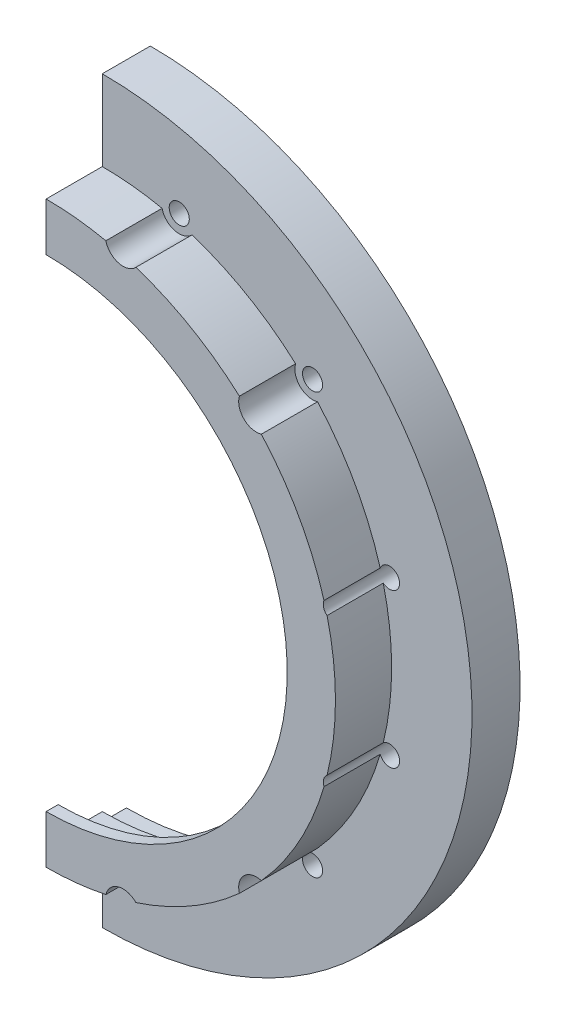
ISO-10303-21;
HEADER;
FILE_DESCRIPTION(('STEP AP214'),'2;1');
FILE_NAME('part.step','',(''),(''),'','','');
FILE_SCHEMA(('AUTOMOTIVE_DESIGN { 1 0 10303 214 1 1 1 1 }'));
ENDSEC;
DATA;
#1=APPLICATION_CONTEXT('core data for automotive mechanical design processes');
#2=APPLICATION_PROTOCOL_DEFINITION('international standard','automotive_design',2000,#1);
#3=PRODUCT_CONTEXT('',#1,'mechanical');
#4=PRODUCT('Part','Part','',(#3));
#5=PRODUCT_RELATED_PRODUCT_CATEGORY('part','',(#4));
#6=PRODUCT_DEFINITION_FORMATION('','',#4);
#7=PRODUCT_DEFINITION_CONTEXT('part definition',#1,'design');
#8=PRODUCT_DEFINITION('design','',#6,#7);
#9=PRODUCT_DEFINITION_SHAPE('','',#8);
#10=(LENGTH_UNIT() NAMED_UNIT(*) SI_UNIT(.MILLI.,.METRE.));
#11=(NAMED_UNIT(*) PLANE_ANGLE_UNIT() SI_UNIT($,.RADIAN.));
#12=(NAMED_UNIT(*) SI_UNIT($,.STERADIAN.) SOLID_ANGLE_UNIT());
#13=UNCERTAINTY_MEASURE_WITH_UNIT(LENGTH_MEASURE(1.E-05),#10,'distance_accuracy_value','');
#14=(GEOMETRIC_REPRESENTATION_CONTEXT(3) GLOBAL_UNCERTAINTY_ASSIGNED_CONTEXT((#13)) GLOBAL_UNIT_ASSIGNED_CONTEXT((#10,
#11,#12)) REPRESENTATION_CONTEXT('',''));
#15=CARTESIAN_POINT('',(0.,0.,0.));
#16=DIRECTION('',(0.,0.,1.));
#17=DIRECTION('',(1.,0.,0.));
#18=AXIS2_PLACEMENT_3D('',#15,#16,#17);
#19=CARTESIAN_POINT('',(0.,0.,-2.98));
#20=DIRECTION('',(0.,0.,1.));
#21=DIRECTION('',(1.,0.,0.));
#22=AXIS2_PLACEMENT_3D('',#19,#20,#21);
#23=PLANE('',#22);
#24=CARTESIAN_POINT('',(0.,0.,-2.98));
#25=DIRECTION('',(0.,0.,1.));
#26=DIRECTION('',(1.,0.,0.));
#27=AXIS2_PLACEMENT_3D('',#24,#25,#26);
#28=CIRCLE('',#27,46.);
#29=CARTESIAN_POINT('',(4.81824424760352E-13,-46.,-2.98));
#30=VERTEX_POINT('',#29);
#31=CARTESIAN_POINT('',(-1.60608141586784E-13,46.,-2.98));
#32=VERTEX_POINT('',#31);
#33=EDGE_CURVE('E374',#30,#32,#28,.T.);
#34=ORIENTED_EDGE('',*,*,#33,.F.);
#35=DIRECTION('',(0.,1.,0.));
#36=VECTOR('',#35,1.);
#37=CARTESIAN_POINT('',(0.,0.,-2.98));
#38=LINE('',#37,#36);
#39=CARTESIAN_POINT('',(4.51099388978533E-13,-41.6,-2.98));
#40=VERTEX_POINT('',#39);
#41=EDGE_CURVE('E384',#30,#40,#38,.T.);
#42=ORIENTED_EDGE('',*,*,#41,.T.);
#43=CARTESIAN_POINT('',(0.,0.,-2.98));
#44=DIRECTION('',(0.,0.,1.));
#45=DIRECTION('',(1.,0.,0.));
#46=AXIS2_PLACEMENT_3D('',#43,#44,#45);
#47=CIRCLE('',#46,41.6);
#48=CARTESIAN_POINT('',(-1.29883105804965E-13,41.6,-2.98));
#49=VERTEX_POINT('',#48);
#50=EDGE_CURVE('E247',#40,#49,#47,.T.);
#51=ORIENTED_EDGE('',*,*,#50,.T.);
#52=EDGE_CURVE('E383',#49,#32,#38,.T.);
#53=ORIENTED_EDGE('',*,*,#52,.T.);
#54=EDGE_LOOP('',(#34,#42,#51,#53));
#55=FACE_BOUND('',#54,.T.);
#56=ADVANCED_FACE('F41',(#55),#23,.F.);
#57=CARTESIAN_POINT('',(0.,0.,8.49));
#58=DIRECTION('',(0.,0.,-1.));
#59=DIRECTION('',(-1.,0.,0.));
#60=AXIS2_PLACEMENT_3D('',#57,#58,#59);
#61=CYLINDRICAL_SURFACE('',#60,36.);
#62=CARTESIAN_POINT('',(0.,0.,3.));
#63=DIRECTION('',(0.,0.,1.));
#64=DIRECTION('',(1.,0.,0.));
#65=AXIS2_PLACEMENT_3D('',#62,#63,#64);
#66=CIRCLE('',#65,36.);
#67=CARTESIAN_POINT('',(7.43766148684493,35.223304666188,3.));
#68=VERTEX_POINT('',#67);
#69=CARTESIAN_POINT('',(-2.51386656396706E-13,36.,3.));
#70=VERTEX_POINT('',#69);
#71=EDGE_CURVE('E370',#68,#70,#66,.T.);
#72=ORIENTED_EDGE('',*,*,#71,.T.);
#73=DIRECTION('',(0.,0.,-1.));
#74=VECTOR('',#73,1.);
#75=CARTESIAN_POINT('',(0.,36.,8.49));
#76=LINE('',#75,#74);
#77=CARTESIAN_POINT('',(0.,36.,9.99));
#78=VERTEX_POINT('',#77);
#79=EDGE_CURVE('E409',#70,#78,#76,.F.);
#80=ORIENTED_EDGE('',*,*,#79,.T.);
#81=CARTESIAN_POINT('',(0.,0.,9.99));
#82=DIRECTION('',(0.,0.,1.));
#83=DIRECTION('',(1.,0.,0.));
#84=AXIS2_PLACEMENT_3D('',#81,#82,#83);
#85=CIRCLE('',#84,36.);
#86=CARTESIAN_POINT('',(7.43766148684494,35.223304666188,9.99));
#87=VERTEX_POINT('',#86);
#88=EDGE_CURVE('E224',#87,#78,#85,.T.);
#89=ORIENTED_EDGE('',*,*,#88,.F.);
#90=DIRECTION('',(0.,0.,-1.));
#91=VECTOR('',#90,1.);
#92=CARTESIAN_POINT('',(7.43766148684493,35.223304666188,6.495));
#93=LINE('',#92,#91);
#94=EDGE_CURVE('E267',#68,#87,#93,.F.);
#95=ORIENTED_EDGE('',*,*,#94,.F.);
#96=EDGE_LOOP('',(#72,#80,#89,#95));
#97=FACE_BOUND('',#96,.T.);
#98=ADVANCED_FACE('F418',(#97),#61,.T.);
#99=CARTESIAN_POINT('',(4.1199479798349E-13,-36.,9.99));
#100=VERTEX_POINT('',#99);
#101=CARTESIAN_POINT('',(7.43766148684494,-35.223304666188,9.99));
#102=VERTEX_POINT('',#101);
#103=EDGE_CURVE('E212',#100,#102,#85,.T.);
#104=ORIENTED_EDGE('',*,*,#103,.F.);
#105=DIRECTION('',(0.,0.,-1.));
#106=VECTOR('',#105,1.);
#107=CARTESIAN_POINT('',(4.1199479798349E-13,-36.,8.49));
#108=LINE('',#107,#106);
#109=CARTESIAN_POINT('',(2.51386656396706E-13,-36.,3.));
#110=VERTEX_POINT('',#109);
#111=EDGE_CURVE('E199',#100,#110,#108,.T.);
#112=ORIENTED_EDGE('',*,*,#111,.T.);
#113=CARTESIAN_POINT('',(7.43766148684494,-35.223304666188,3.));
#114=VERTEX_POINT('',#113);
#115=EDGE_CURVE('E367',#110,#114,#66,.T.);
#116=ORIENTED_EDGE('',*,*,#115,.T.);
#117=DIRECTION('',(0.,0.,-1.));
#118=VECTOR('',#117,1.);
#119=CARTESIAN_POINT('',(7.43766148684493,-35.223304666188,6.495));
#120=LINE('',#119,#118);
#121=EDGE_CURVE('E223',#114,#102,#120,.F.);
#122=ORIENTED_EDGE('',*,*,#121,.T.);
#123=EDGE_LOOP('',(#104,#112,#116,#122));
#124=FACE_BOUND('',#123,.T.);
#125=ADVANCED_FACE('F221',(#124),#61,.T.);
#126=CARTESIAN_POINT('',(34.5745243609655,10.0300680562499,3.));
#127=VERTEX_POINT('',#126);
#128=CARTESIAN_POINT('',(26.7854459050887,24.0528561228301,3.));
#129=VERTEX_POINT('',#128);
#130=EDGE_CURVE('E422',#127,#129,#66,.T.);
#131=ORIENTED_EDGE('',*,*,#130,.T.);
#132=DIRECTION('',(0.,0.,-1.));
#133=VECTOR('',#132,1.);
#134=CARTESIAN_POINT('',(26.7854459050887,24.0528561228301,6.495));
#135=LINE('',#134,#133);
#136=CARTESIAN_POINT('',(26.7854459050887,24.0528561228302,9.99));
#137=VERTEX_POINT('',#136);
#138=EDGE_CURVE('E290',#137,#129,#135,.T.);
#139=ORIENTED_EDGE('',*,*,#138,.F.);
#140=CARTESIAN_POINT('',(34.5745243609655,10.0300680562498,9.99));
#141=VERTEX_POINT('',#140);
#142=EDGE_CURVE('E236',#141,#137,#85,.T.);
#143=ORIENTED_EDGE('',*,*,#142,.F.);
#144=DIRECTION('',(0.,0.,-1.));
#145=VECTOR('',#144,1.);
#146=CARTESIAN_POINT('',(34.5745243609655,10.0300680562499,6.495));
#147=LINE('',#146,#145);
#148=EDGE_CURVE('E295',#127,#141,#147,.F.);
#149=ORIENTED_EDGE('',*,*,#148,.F.);
#150=EDGE_LOOP('',(#131,#139,#143,#149));
#151=FACE_BOUND('',#150,.T.);
#152=ADVANCED_FACE('F443',(#151),#61,.T.);
#153=CARTESIAN_POINT('',(34.9574504476187,-8.60096844560432,3.));
#154=VERTEX_POINT('',#153);
#155=CARTESIAN_POINT('',(34.9574504476187,8.60096844560434,3.));
#156=VERTEX_POINT('',#155);
#157=EDGE_CURVE('E371',#154,#156,#66,.T.);
#158=ORIENTED_EDGE('',*,*,#157,.T.);
#159=DIRECTION('',(0.,0.,-1.));
#160=VECTOR('',#159,1.);
#161=CARTESIAN_POINT('',(34.9574504476187,8.60096844560439,6.495));
#162=LINE('',#161,#160);
#163=CARTESIAN_POINT('',(34.9574504476187,8.6009684456044,9.99));
#164=VERTEX_POINT('',#163);
#165=EDGE_CURVE('E287',#164,#156,#162,.T.);
#166=ORIENTED_EDGE('',*,*,#165,.F.);
#167=CARTESIAN_POINT('',(34.9574504476187,-8.6009684456044,9.99));
#168=VERTEX_POINT('',#167);
#169=EDGE_CURVE('E228',#168,#164,#85,.T.);
#170=ORIENTED_EDGE('',*,*,#169,.F.);
#171=DIRECTION('',(0.,0.,-1.));
#172=VECTOR('',#171,1.);
#173=CARTESIAN_POINT('',(34.9574504476187,-8.60096844560439,6.495));
#174=LINE('',#173,#172);
#175=EDGE_CURVE('E301',#168,#154,#174,.T.);
#176=ORIENTED_EDGE('',*,*,#175,.T.);
#177=EDGE_LOOP('',(#158,#166,#170,#176));
#178=FACE_BOUND('',#177,.T.);
#179=ADVANCED_FACE('F434',(#178),#61,.T.);
#180=DIRECTION('',(0.,0.,-1.));
#181=VECTOR('',#180,1.);
#182=CARTESIAN_POINT('',(34.5745243609655,-10.0300680562499,6.495));
#183=LINE('',#182,#181);
#184=CARTESIAN_POINT('',(34.5745243609655,-10.0300680562499,3.));
#185=VERTEX_POINT('',#184);
#186=CARTESIAN_POINT('',(34.5745243609655,-10.0300680562498,9.99));
#187=VERTEX_POINT('',#186);
#188=EDGE_CURVE('E296',#185,#187,#183,.F.);
#189=ORIENTED_EDGE('',*,*,#188,.T.);
#190=CARTESIAN_POINT('',(26.7854459050887,-24.0528561228302,9.99));
#191=VERTEX_POINT('',#190);
#192=EDGE_CURVE('E227',#191,#187,#85,.T.);
#193=ORIENTED_EDGE('',*,*,#192,.F.);
#194=DIRECTION('',(0.,0.,-1.));
#195=VECTOR('',#194,1.);
#196=CARTESIAN_POINT('',(26.7854459050887,-24.0528561228301,6.495));
#197=LINE('',#196,#195);
#198=CARTESIAN_POINT('',(26.7854459050887,-24.0528561228301,3.));
#199=VERTEX_POINT('',#198);
#200=EDGE_CURVE('E279',#191,#199,#197,.T.);
#201=ORIENTED_EDGE('',*,*,#200,.T.);
#202=EDGE_CURVE('E423',#199,#185,#66,.T.);
#203=ORIENTED_EDGE('',*,*,#202,.T.);
#204=EDGE_LOOP('',(#189,#193,#201,#203));
#205=FACE_BOUND('',#204,.T.);
#206=ADVANCED_FACE('F526',(#205),#61,.T.);
#207=CARTESIAN_POINT('',(24.0528561228302,26.7854459050887,9.99));
#208=VERTEX_POINT('',#207);
#209=CARTESIAN_POINT('',(11.170448544184,34.2231073884552,9.99));
#210=VERTEX_POINT('',#209);
#211=EDGE_CURVE('E230',#208,#210,#85,.T.);
#212=ORIENTED_EDGE('',*,*,#211,.F.);
#213=DIRECTION('',(0.,0.,-1.));
#214=VECTOR('',#213,1.);
#215=CARTESIAN_POINT('',(24.0528561228301,26.7854459050887,6.495));
#216=LINE('',#215,#214);
#217=CARTESIAN_POINT('',(24.0528561228301,26.7854459050887,3.));
#218=VERTEX_POINT('',#217);
#219=EDGE_CURVE('E260',#218,#208,#216,.F.);
#220=ORIENTED_EDGE('',*,*,#219,.F.);
#221=CARTESIAN_POINT('',(11.170448544184,34.2231073884552,3.));
#222=VERTEX_POINT('',#221);
#223=EDGE_CURVE('E264',#218,#222,#66,.T.);
#224=ORIENTED_EDGE('',*,*,#223,.T.);
#225=DIRECTION('',(0.,0.,-1.));
#226=VECTOR('',#225,1.);
#227=CARTESIAN_POINT('',(11.170448544184,34.2231073884552,6.495));
#228=LINE('',#227,#226);
#229=EDGE_CURVE('E263',#210,#222,#228,.T.);
#230=ORIENTED_EDGE('',*,*,#229,.F.);
#231=EDGE_LOOP('',(#212,#220,#224,#230));
#232=FACE_BOUND('',#231,.T.);
#233=ADVANCED_FACE('F258',(#232),#61,.T.);
#234=DIRECTION('',(0.,0.,-1.));
#235=VECTOR('',#234,1.);
#236=CARTESIAN_POINT('',(11.170448544184,-34.2231073884552,6.495));
#237=LINE('',#236,#235);
#238=CARTESIAN_POINT('',(11.170448544184,-34.2231073884552,9.99));
#239=VERTEX_POINT('',#238);
#240=CARTESIAN_POINT('',(11.170448544184,-34.2231073884552,3.));
#241=VERTEX_POINT('',#240);
#242=EDGE_CURVE('E307',#239,#241,#237,.T.);
#243=ORIENTED_EDGE('',*,*,#242,.T.);
#244=CARTESIAN_POINT('',(24.0528561228301,-26.7854459050887,3.));
#245=VERTEX_POINT('',#244);
#246=EDGE_CURVE('E369',#241,#245,#66,.T.);
#247=ORIENTED_EDGE('',*,*,#246,.T.);
#248=DIRECTION('',(0.,0.,-1.));
#249=VECTOR('',#248,1.);
#250=CARTESIAN_POINT('',(24.0528561228301,-26.7854459050887,6.495));
#251=LINE('',#250,#249);
#252=CARTESIAN_POINT('',(24.0528561228302,-26.7854459050887,9.99));
#253=VERTEX_POINT('',#252);
#254=EDGE_CURVE('E282',#245,#253,#251,.F.);
#255=ORIENTED_EDGE('',*,*,#254,.T.);
#256=EDGE_CURVE('E225',#239,#253,#85,.T.);
#257=ORIENTED_EDGE('',*,*,#256,.F.);
#258=EDGE_LOOP('',(#243,#247,#255,#257));
#259=FACE_BOUND('',#258,.T.);
#260=ADVANCED_FACE('F465',(#259),#61,.T.);
#261=CARTESIAN_POINT('',(0.,0.,9.99));
#262=DIRECTION('',(0.,0.,1.));
#263=DIRECTION('',(1.,0.,0.));
#264=AXIS2_PLACEMENT_3D('',#261,#262,#263);
#265=PLANE('',#264);
#266=DIRECTION('',(0.,1.,0.));
#267=VECTOR('',#266,1.);
#268=CARTESIAN_POINT('',(-1.60608141586784E-13,46.,9.99));
#269=LINE('',#268,#267);
#270=CARTESIAN_POINT('',(3.70097021917372E-13,-30.,9.99));
#271=VERTEX_POINT('',#270);
#272=EDGE_CURVE('E63',#100,#271,#269,.T.);
#273=ORIENTED_EDGE('',*,*,#272,.F.);
#274=ORIENTED_EDGE('',*,*,#103,.T.);
#275=CARTESIAN_POINT('',(9.57630467,-35.73925557,9.99));
#276=DIRECTION('',(0.,0.,1.));
#277=DIRECTION('',(1.,0.,0.));
#278=AXIS2_PLACEMENT_3D('',#275,#276,#277);
#279=CIRCLE('',#278,2.2);
#280=EDGE_CURVE('E266',#239,#102,#279,.T.);
#281=ORIENTED_EDGE('',*,*,#280,.F.);
#282=ORIENTED_EDGE('',*,*,#256,.T.);
#283=CARTESIAN_POINT('',(26.1629509,-26.1629509,9.99));
#284=DIRECTION('',(0.,0.,1.));
#285=DIRECTION('',(1.,0.,0.));
#286=AXIS2_PLACEMENT_3D('',#283,#284,#285);
#287=CIRCLE('',#286,2.2);
#288=EDGE_CURVE('E206',#191,#253,#287,.T.);
#289=ORIENTED_EDGE('',*,*,#288,.F.);
#290=ORIENTED_EDGE('',*,*,#192,.T.);
#291=CARTESIAN_POINT('',(35.73925557,-9.57630467,9.99));
#292=DIRECTION('',(0.,0.,1.));
#293=DIRECTION('',(1.,0.,0.));
#294=AXIS2_PLACEMENT_3D('',#291,#292,#293);
#295=CIRCLE('',#294,1.24999999999996);
#296=EDGE_CURVE('E299',#168,#187,#295,.T.);
#297=ORIENTED_EDGE('',*,*,#296,.F.);
#298=ORIENTED_EDGE('',*,*,#169,.T.);
#299=CARTESIAN_POINT('',(35.73925557,9.57630467,9.99));
#300=DIRECTION('',(0.,0.,1.));
#301=DIRECTION('',(1.,0.,0.));
#302=AXIS2_PLACEMENT_3D('',#299,#300,#301);
#303=CIRCLE('',#302,1.24999999999996);
#304=EDGE_CURVE('E293',#164,#141,#303,.F.);
#305=ORIENTED_EDGE('',*,*,#304,.T.);
#306=ORIENTED_EDGE('',*,*,#142,.T.);
#307=CARTESIAN_POINT('',(26.1629509,26.1629509,9.99));
#308=DIRECTION('',(0.,0.,1.));
#309=DIRECTION('',(1.,0.,0.));
#310=AXIS2_PLACEMENT_3D('',#307,#308,#309);
#311=CIRCLE('',#310,2.2);
#312=EDGE_CURVE('E254',#137,#208,#311,.F.);
#313=ORIENTED_EDGE('',*,*,#312,.T.);
#314=ORIENTED_EDGE('',*,*,#211,.T.);
#315=CARTESIAN_POINT('',(9.57630467,35.73925557,9.99));
#316=DIRECTION('',(0.,0.,1.));
#317=DIRECTION('',(1.,0.,0.));
#318=AXIS2_PLACEMENT_3D('',#315,#316,#317);
#319=CIRCLE('',#318,2.2);
#320=EDGE_CURVE('E252',#210,#87,#319,.F.);
#321=ORIENTED_EDGE('',*,*,#320,.T.);
#322=ORIENTED_EDGE('',*,*,#88,.T.);
#323=CARTESIAN_POINT('',(0.,30.,9.99));
#324=VERTEX_POINT('',#323);
#325=EDGE_CURVE('E218',#324,#78,#269,.T.);
#326=ORIENTED_EDGE('',*,*,#325,.F.);
#327=CARTESIAN_POINT('',(0.,0.,9.99));
#328=DIRECTION('',(0.,0.,1.));
#329=DIRECTION('',(1.,0.,0.));
#330=AXIS2_PLACEMENT_3D('',#327,#328,#329);
#331=CIRCLE('',#330,30.);
#332=EDGE_CURVE('E216',#271,#324,#331,.T.);
#333=ORIENTED_EDGE('',*,*,#332,.F.);
#334=EDGE_LOOP('',(#273,#274,#281,#282,#289,#290,#297,#298,#305,#306,#313,#314,#321,#322,#326,#333));
#335=FACE_BOUND('',#334,.T.);
#336=ADVANCED_FACE('F210',(#335),#265,.T.);
#337=CARTESIAN_POINT('',(0.,0.,0.));
#338=DIRECTION('',(0.,0.,1.));
#339=DIRECTION('',(1.,0.,0.));
#340=AXIS2_PLACEMENT_3D('',#337,#338,#339);
#341=PLANE('',#340);
#342=CARTESIAN_POINT('',(9.57630467,35.73925557,0.));
#343=DIRECTION('',(0.,0.,1.));
#344=DIRECTION('',(1.,0.,0.));
#345=AXIS2_PLACEMENT_3D('',#342,#343,#344);
#346=CIRCLE('',#345,1.25);
#347=CARTESIAN_POINT('',(10.82630467,35.73925557,0.));
#348=VERTEX_POINT('',#347);
#349=EDGE_CURVE('E313',#348,#348,#346,.T.);
#350=ORIENTED_EDGE('',*,*,#349,.T.);
#351=EDGE_LOOP('',(#350));
#352=FACE_BOUND('',#351,.T.);
#353=CARTESIAN_POINT('',(26.1629509,26.1629509,0.));
#354=DIRECTION('',(0.,0.,1.));
#355=DIRECTION('',(1.,0.,0.));
#356=AXIS2_PLACEMENT_3D('',#353,#354,#355);
#357=CIRCLE('',#356,1.25);
#358=CARTESIAN_POINT('',(27.4129509,26.1629509,0.));
#359=VERTEX_POINT('',#358);
#360=EDGE_CURVE('E319',#359,#359,#357,.T.);
#361=ORIENTED_EDGE('',*,*,#360,.T.);
#362=EDGE_LOOP('',(#361));
#363=FACE_BOUND('',#362,.T.);
#364=CARTESIAN_POINT('',(35.73925557,9.57630467,0.));
#365=DIRECTION('',(0.,0.,1.));
#366=DIRECTION('',(1.,0.,0.));
#367=AXIS2_PLACEMENT_3D('',#364,#365,#366);
#368=CIRCLE('',#367,1.25);
#369=CARTESIAN_POINT('',(36.98925557,9.57630467,0.));
#370=VERTEX_POINT('',#369);
#371=EDGE_CURVE('E325',#370,#370,#368,.T.);
#372=ORIENTED_EDGE('',*,*,#371,.T.);
#373=EDGE_LOOP('',(#372));
#374=FACE_BOUND('',#373,.T.);
#375=CARTESIAN_POINT('',(35.73925557,-9.57630467,0.));
#376=DIRECTION('',(0.,0.,1.));
#377=DIRECTION('',(1.,0.,0.));
#378=AXIS2_PLACEMENT_3D('',#375,#376,#377);
#379=CIRCLE('',#378,1.25);
#380=CARTESIAN_POINT('',(36.98925557,-9.57630467,0.));
#381=VERTEX_POINT('',#380);
#382=EDGE_CURVE('E331',#381,#381,#379,.T.);
#383=ORIENTED_EDGE('',*,*,#382,.T.);
#384=EDGE_LOOP('',(#383));
#385=FACE_BOUND('',#384,.T.);
#386=CARTESIAN_POINT('',(26.1629509,-26.1629509,0.));
#387=DIRECTION('',(0.,0.,1.));
#388=DIRECTION('',(1.,0.,0.));
#389=AXIS2_PLACEMENT_3D('',#386,#387,#388);
#390=CIRCLE('',#389,1.25);
#391=CARTESIAN_POINT('',(27.4129509,-26.1629509,0.));
#392=VERTEX_POINT('',#391);
#393=EDGE_CURVE('E337',#392,#392,#390,.T.);
#394=ORIENTED_EDGE('',*,*,#393,.T.);
#395=EDGE_LOOP('',(#394));
#396=FACE_BOUND('',#395,.T.);
#397=CARTESIAN_POINT('',(9.57630467,-35.73925557,0.));
#398=DIRECTION('',(0.,0.,1.));
#399=DIRECTION('',(1.,0.,0.));
#400=AXIS2_PLACEMENT_3D('',#397,#398,#399);
#401=CIRCLE('',#400,1.25);
#402=CARTESIAN_POINT('',(10.82630467,-35.73925557,0.));
#403=VERTEX_POINT('',#402);
#404=EDGE_CURVE('E343',#403,#403,#401,.T.);
#405=ORIENTED_EDGE('',*,*,#404,.T.);
#406=EDGE_LOOP('',(#405));
#407=FACE_BOUND('',#406,.T.);
#408=CARTESIAN_POINT('',(0.,0.,0.));
#409=DIRECTION('',(0.,0.,1.));
#410=DIRECTION('',(1.,0.,0.));
#411=AXIS2_PLACEMENT_3D('',#408,#409,#410);
#412=CIRCLE('',#411,41.6);
#413=CARTESIAN_POINT('',(2.90491247391749E-13,-41.6,0.));
#414=VERTEX_POINT('',#413);
#415=CARTESIAN_POINT('',(-2.90491247391749E-13,41.6,0.));
#416=VERTEX_POINT('',#415);
#417=EDGE_CURVE('E354',#414,#416,#412,.T.);
#418=ORIENTED_EDGE('',*,*,#417,.F.);
#419=DIRECTION('',(0.,1.,0.));
#420=VECTOR('',#419,1.);
#421=CARTESIAN_POINT('',(0.,0.,0.));
#422=LINE('',#421,#420);
#423=CARTESIAN_POINT('',(4.02218650234729E-13,-34.6,0.));
#424=VERTEX_POINT('',#423);
#425=EDGE_CURVE('E398',#414,#424,#422,.T.);
#426=ORIENTED_EDGE('',*,*,#425,.T.);
#427=CARTESIAN_POINT('',(0.,0.,0.));
#428=DIRECTION('',(0.,0.,1.));
#429=DIRECTION('',(1.,0.,0.));
#430=AXIS2_PLACEMENT_3D('',#427,#428,#429);
#431=CIRCLE('',#430,34.6);
#432=CARTESIAN_POINT('',(0.,34.6,0.));
#433=VERTEX_POINT('',#432);
#434=EDGE_CURVE('E361',#424,#433,#431,.T.);
#435=ORIENTED_EDGE('',*,*,#434,.T.);
#436=EDGE_CURVE('E393',#433,#416,#422,.T.);
#437=ORIENTED_EDGE('',*,*,#436,.T.);
#438=EDGE_LOOP('',(#418,#426,#435,#437));
#439=FACE_BOUND('',#438,.T.);
#440=ADVANCED_FACE('F482',(#352,#363,#374,#385,#396,#407,#439),#341,.F.);
#441=CARTESIAN_POINT('',(0.,0.,3.));
#442=DIRECTION('',(0.,0.,1.));
#443=DIRECTION('',(1.,0.,0.));
#444=AXIS2_PLACEMENT_3D('',#441,#442,#443);
#445=PLANE('',#444);
#446=DIRECTION('',(0.,1.,0.));
#447=VECTOR('',#446,1.);
#448=CARTESIAN_POINT('',(0.,0.,3.));
#449=LINE('',#448,#447);
#450=CARTESIAN_POINT('',(4.81824424760352E-13,-46.,3.));
#451=VERTEX_POINT('',#450);
#452=EDGE_CURVE('E202',#451,#110,#449,.T.);
#453=ORIENTED_EDGE('',*,*,#452,.F.);
#454=CARTESIAN_POINT('',(0.,0.,3.));
#455=DIRECTION('',(0.,0.,1.));
#456=DIRECTION('',(1.,0.,0.));
#457=AXIS2_PLACEMENT_3D('',#454,#455,#456);
#458=CIRCLE('',#457,46.);
#459=CARTESIAN_POINT('',(-1.60608141586784E-13,46.,3.));
#460=VERTEX_POINT('',#459);
#461=EDGE_CURVE('E356',#451,#460,#458,.T.);
#462=ORIENTED_EDGE('',*,*,#461,.T.);
#463=EDGE_CURVE('E407',#70,#460,#449,.T.);
#464=ORIENTED_EDGE('',*,*,#463,.F.);
#465=ORIENTED_EDGE('',*,*,#71,.F.);
#466=CARTESIAN_POINT('',(9.57630467,35.73925557,3.));
#467=DIRECTION('',(0.,0.,-1.));
#468=DIRECTION('',(-1.,0.,0.));
#469=AXIS2_PLACEMENT_3D('',#466,#467,#468);
#470=CIRCLE('',#469,2.2);
#471=EDGE_CURVE('E271',#222,#68,#470,.T.);
#472=ORIENTED_EDGE('',*,*,#471,.F.);
#473=ORIENTED_EDGE('',*,*,#223,.F.);
#474=CARTESIAN_POINT('',(26.1629509,26.1629509,3.));
#475=DIRECTION('',(0.,0.,1.));
#476=DIRECTION('',(1.,0.,0.));
#477=AXIS2_PLACEMENT_3D('',#474,#475,#476);
#478=CIRCLE('',#477,2.2);
#479=EDGE_CURVE('E286',#129,#218,#478,.F.);
#480=ORIENTED_EDGE('',*,*,#479,.F.);
#481=ORIENTED_EDGE('',*,*,#130,.F.);
#482=CARTESIAN_POINT('',(35.73925557,9.57630467,3.));
#483=DIRECTION('',(0.,0.,1.));
#484=DIRECTION('',(1.,0.,0.));
#485=AXIS2_PLACEMENT_3D('',#482,#483,#484);
#486=CIRCLE('',#485,1.25);
#487=EDGE_CURVE('E322',#156,#127,#486,.T.);
#488=ORIENTED_EDGE('',*,*,#487,.F.);
#489=ORIENTED_EDGE('',*,*,#157,.F.);
#490=CARTESIAN_POINT('',(35.73925557,-9.57630467,3.));
#491=DIRECTION('',(0.,0.,1.));
#492=DIRECTION('',(1.,0.,0.));
#493=AXIS2_PLACEMENT_3D('',#490,#491,#492);
#494=CIRCLE('',#493,1.25);
#495=EDGE_CURVE('E328',#185,#154,#494,.T.);
#496=ORIENTED_EDGE('',*,*,#495,.F.);
#497=ORIENTED_EDGE('',*,*,#202,.F.);
#498=CARTESIAN_POINT('',(26.1629509,-26.1629509,3.));
#499=DIRECTION('',(0.,0.,1.));
#500=DIRECTION('',(1.,0.,0.));
#501=AXIS2_PLACEMENT_3D('',#498,#499,#500);
#502=CIRCLE('',#501,2.2);
#503=EDGE_CURVE('E276',#199,#245,#502,.T.);
#504=ORIENTED_EDGE('',*,*,#503,.T.);
#505=ORIENTED_EDGE('',*,*,#246,.F.);
#506=CARTESIAN_POINT('',(9.57630467,-35.73925557,3.));
#507=DIRECTION('',(0.,0.,1.));
#508=DIRECTION('',(1.,0.,0.));
#509=AXIS2_PLACEMENT_3D('',#506,#507,#508);
#510=CIRCLE('',#509,2.2);
#511=EDGE_CURVE('E269',#241,#114,#510,.T.);
#512=ORIENTED_EDGE('',*,*,#511,.T.);
#513=ORIENTED_EDGE('',*,*,#115,.F.);
#514=EDGE_LOOP('',(#453,#462,#464,#465,#472,#473,#480,#481,#488,#489,#496,#497,#504,#505,#512,#513));
#515=FACE_BOUND('',#514,.T.);
#516=CARTESIAN_POINT('',(26.1629509,26.1629509,3.));
#517=DIRECTION('',(0.,0.,1.));
#518=DIRECTION('',(1.,0.,0.));
#519=AXIS2_PLACEMENT_3D('',#516,#517,#518);
#520=CIRCLE('',#519,1.25);
#521=CARTESIAN_POINT('',(27.4129509,26.1629509,3.));
#522=VERTEX_POINT('',#521);
#523=EDGE_CURVE('E316',#522,#522,#520,.T.);
#524=ORIENTED_EDGE('',*,*,#523,.F.);
#525=EDGE_LOOP('',(#524));
#526=FACE_BOUND('',#525,.T.);
#527=CARTESIAN_POINT('',(9.57630467,-35.73925557,3.));
#528=DIRECTION('',(0.,0.,1.));
#529=DIRECTION('',(1.,0.,0.));
#530=AXIS2_PLACEMENT_3D('',#527,#528,#529);
#531=CIRCLE('',#530,1.25);
#532=CARTESIAN_POINT('',(10.82630467,-35.73925557,3.));
#533=VERTEX_POINT('',#532);
#534=EDGE_CURVE('E340',#533,#533,#531,.T.);
#535=ORIENTED_EDGE('',*,*,#534,.F.);
#536=EDGE_LOOP('',(#535));
#537=FACE_BOUND('',#536,.T.);
#538=CARTESIAN_POINT('',(9.57630467,35.73925557,3.));
#539=DIRECTION('',(0.,0.,1.));
#540=DIRECTION('',(1.,0.,0.));
#541=AXIS2_PLACEMENT_3D('',#538,#539,#540);
#542=CIRCLE('',#541,1.25);
#543=CARTESIAN_POINT('',(10.82630467,35.73925557,3.));
#544=VERTEX_POINT('',#543);
#545=EDGE_CURVE('E292',#544,#544,#542,.T.);
#546=ORIENTED_EDGE('',*,*,#545,.F.);
#547=EDGE_LOOP('',(#546));
#548=FACE_BOUND('',#547,.T.);
#549=CARTESIAN_POINT('',(26.1629509,-26.1629509,3.));
#550=DIRECTION('',(0.,0.,1.));
#551=DIRECTION('',(1.,0.,0.));
#552=AXIS2_PLACEMENT_3D('',#549,#550,#551);
#553=CIRCLE('',#552,1.25);
#554=CARTESIAN_POINT('',(27.4129509,-26.1629509,3.));
#555=VERTEX_POINT('',#554);
#556=EDGE_CURVE('E334',#555,#555,#553,.T.);
#557=ORIENTED_EDGE('',*,*,#556,.F.);
#558=EDGE_LOOP('',(#557));
#559=FACE_BOUND('',#558,.T.);
#560=ADVANCED_FACE('F420',(#515,#526,#537,#548,#559),#445,.T.);
#561=CARTESIAN_POINT('',(0.,0.,3.));
#562=DIRECTION('',(0.,0.,-1.));
#563=DIRECTION('',(-1.,0.,0.));
#564=AXIS2_PLACEMENT_3D('',#561,#562,#563);
#565=CYLINDRICAL_SURFACE('',#564,46.);
#566=ORIENTED_EDGE('',*,*,#33,.T.);
#567=DIRECTION('',(0.,0.,1.));
#568=VECTOR('',#567,1.);
#569=CARTESIAN_POINT('',(-1.60608141586784E-13,46.,-39.48));
#570=LINE('',#569,#568);
#571=EDGE_CURVE('E514',#32,#460,#570,.T.);
#572=ORIENTED_EDGE('',*,*,#571,.T.);
#573=ORIENTED_EDGE('',*,*,#461,.F.);
#574=DIRECTION('',(0.,0.,1.));
#575=VECTOR('',#574,1.);
#576=CARTESIAN_POINT('',(4.81824424760352E-13,-46.,-39.48));
#577=LINE('',#576,#575);
#578=EDGE_CURVE('E217',#30,#451,#577,.T.);
#579=ORIENTED_EDGE('',*,*,#578,.F.);
#580=EDGE_LOOP('',(#566,#572,#573,#579));
#581=FACE_BOUND('',#580,.T.);
#582=ADVANCED_FACE('F43',(#581),#565,.T.);
#583=CARTESIAN_POINT('',(0.,0.,3.));
#584=DIRECTION('',(0.,0.,-1.));
#585=DIRECTION('',(-1.,0.,0.));
#586=AXIS2_PLACEMENT_3D('',#583,#584,#585);
#587=CYLINDRICAL_SURFACE('',#586,34.6);
#588=DIRECTION('',(0.,0.,-1.));
#589=VECTOR('',#588,1.);
#590=CARTESIAN_POINT('',(4.02218650234729E-13,-34.6,3.));
#591=LINE('',#590,#589);
#592=CARTESIAN_POINT('',(2.41610508647945E-13,-34.6,3.));
#593=VERTEX_POINT('',#592);
#594=EDGE_CURVE('E404',#593,#424,#591,.T.);
#595=ORIENTED_EDGE('',*,*,#594,.F.);
#596=CARTESIAN_POINT('',(0.,0.,3.));
#597=DIRECTION('',(0.,0.,1.));
#598=DIRECTION('',(1.,0.,0.));
#599=AXIS2_PLACEMENT_3D('',#596,#597,#598);
#600=CIRCLE('',#599,34.6);
#601=CARTESIAN_POINT('',(-2.41610508647945E-13,34.6,3.));
#602=VERTEX_POINT('',#601);
#603=EDGE_CURVE('E364',#593,#602,#600,.T.);
#604=ORIENTED_EDGE('',*,*,#603,.T.);
#605=DIRECTION('',(0.,0.,-1.));
#606=VECTOR('',#605,1.);
#607=CARTESIAN_POINT('',(0.,34.6,3.));
#608=LINE('',#607,#606);
#609=EDGE_CURVE('E396',#433,#602,#608,.F.);
#610=ORIENTED_EDGE('',*,*,#609,.F.);
#611=ORIENTED_EDGE('',*,*,#434,.F.);
#612=EDGE_LOOP('',(#595,#604,#610,#611));
#613=FACE_BOUND('',#612,.T.);
#614=ADVANCED_FACE('F475',(#613),#587,.F.);
#615=CARTESIAN_POINT('',(0.,0.,3.));
#616=DIRECTION('',(0.,0.,1.));
#617=DIRECTION('',(1.,0.,0.));
#618=AXIS2_PLACEMENT_3D('',#615,#616,#617);
#619=PLANE('',#618);
#620=ORIENTED_EDGE('',*,*,#603,.F.);
#621=DIRECTION('',(0.,1.,0.));
#622=VECTOR('',#621,1.);
#623=CARTESIAN_POINT('',(0.,0.,3.));
#624=LINE('',#623,#622);
#625=CARTESIAN_POINT('',(3.94537391289274E-13,-33.5,3.));
#626=VERTEX_POINT('',#625);
#627=EDGE_CURVE('E403',#593,#626,#624,.T.);
#628=ORIENTED_EDGE('',*,*,#627,.T.);
#629=CARTESIAN_POINT('',(0.,0.,3.));
#630=DIRECTION('',(0.,0.,1.));
#631=DIRECTION('',(1.,0.,0.));
#632=AXIS2_PLACEMENT_3D('',#629,#630,#631);
#633=CIRCLE('',#632,33.5);
#634=CARTESIAN_POINT('',(0.,33.5,3.));
#635=VERTEX_POINT('',#634);
#636=EDGE_CURVE('E372',#626,#635,#633,.T.);
#637=ORIENTED_EDGE('',*,*,#636,.T.);
#638=EDGE_CURVE('E508',#635,#602,#624,.T.);
#639=ORIENTED_EDGE('',*,*,#638,.T.);
#640=EDGE_LOOP('',(#620,#628,#637,#639));
#641=FACE_BOUND('',#640,.T.);
#642=ADVANCED_FACE('F472',(#641),#619,.F.);
#643=CARTESIAN_POINT('',(0.,0.,8.49));
#644=DIRECTION('',(0.,0.,-1.));
#645=DIRECTION('',(-1.,0.,0.));
#646=AXIS2_PLACEMENT_3D('',#643,#644,#645);
#647=CYLINDRICAL_SURFACE('',#646,33.5);
#648=DIRECTION('',(0.,0.,-1.));
#649=VECTOR('',#648,1.);
#650=CARTESIAN_POINT('',(3.94537391289274E-13,-33.5,8.49));
#651=LINE('',#650,#649);
#652=CARTESIAN_POINT('',(2.3392924970249E-13,-33.5,8.49));
#653=VERTEX_POINT('',#652);
#654=EDGE_CURVE('E401',#653,#626,#651,.T.);
#655=ORIENTED_EDGE('',*,*,#654,.F.);
#656=CARTESIAN_POINT('',(0.,0.,8.49));
#657=DIRECTION('',(0.,0.,1.));
#658=DIRECTION('',(1.,0.,0.));
#659=AXIS2_PLACEMENT_3D('',#656,#657,#658);
#660=CIRCLE('',#659,33.5);
#661=CARTESIAN_POINT('',(-2.3392924970249E-13,33.5,8.49));
#662=VERTEX_POINT('',#661);
#663=EDGE_CURVE('E243',#653,#662,#660,.T.);
#664=ORIENTED_EDGE('',*,*,#663,.T.);
#665=DIRECTION('',(0.,0.,-1.));
#666=VECTOR('',#665,1.);
#667=CARTESIAN_POINT('',(0.,33.5,8.49));
#668=LINE('',#667,#666);
#669=EDGE_CURVE('E509',#635,#662,#668,.F.);
#670=ORIENTED_EDGE('',*,*,#669,.F.);
#671=ORIENTED_EDGE('',*,*,#636,.F.);
#672=EDGE_LOOP('',(#655,#664,#670,#671));
#673=FACE_BOUND('',#672,.T.);
#674=ADVANCED_FACE('F469',(#673),#647,.F.);
#675=CARTESIAN_POINT('',(0.,0.,-2.98));
#676=DIRECTION('',(0.,0.,1.));
#677=DIRECTION('',(1.,0.,0.));
#678=AXIS2_PLACEMENT_3D('',#675,#676,#677);
#679=CYLINDRICAL_SURFACE('',#678,41.6);
#680=ORIENTED_EDGE('',*,*,#417,.T.);
#681=DIRECTION('',(0.,0.,1.));
#682=VECTOR('',#681,1.);
#683=CARTESIAN_POINT('',(-1.29883105804965E-13,41.6,-2.98));
#684=LINE('',#683,#682);
#685=EDGE_CURVE('E391',#416,#49,#684,.F.);
#686=ORIENTED_EDGE('',*,*,#685,.T.);
#687=ORIENTED_EDGE('',*,*,#50,.F.);
#688=DIRECTION('',(0.,0.,1.));
#689=VECTOR('',#688,1.);
#690=CARTESIAN_POINT('',(4.51099388978533E-13,-41.6,-2.98));
#691=LINE('',#690,#689);
#692=EDGE_CURVE('E389',#40,#414,#691,.T.);
#693=ORIENTED_EDGE('',*,*,#692,.T.);
#694=EDGE_LOOP('',(#680,#686,#687,#693));
#695=FACE_BOUND('',#694,.T.);
#696=ADVANCED_FACE('F388',(#695),#679,.F.);
#697=CARTESIAN_POINT('',(0.,0.,8.49));
#698=DIRECTION('',(0.,0.,1.));
#699=DIRECTION('',(1.,0.,0.));
#700=AXIS2_PLACEMENT_3D('',#697,#698,#699);
#701=PLANE('',#700);
#702=ORIENTED_EDGE('',*,*,#663,.F.);
#703=DIRECTION('',(0.,1.,0.));
#704=VECTOR('',#703,1.);
#705=CARTESIAN_POINT('',(0.,0.,8.49));
#706=LINE('',#705,#704);
#707=CARTESIAN_POINT('',(3.70097021917372E-13,-30.,8.49));
#708=VERTEX_POINT('',#707);
#709=EDGE_CURVE('E351',#653,#708,#706,.T.);
#710=ORIENTED_EDGE('',*,*,#709,.T.);
#711=CARTESIAN_POINT('',(0.,0.,8.49));
#712=DIRECTION('',(0.,0.,1.));
#713=DIRECTION('',(1.,0.,0.));
#714=AXIS2_PLACEMENT_3D('',#711,#712,#713);
#715=CIRCLE('',#714,30.);
#716=CARTESIAN_POINT('',(0.,30.,8.49));
#717=VERTEX_POINT('',#716);
#718=EDGE_CURVE('E240',#708,#717,#715,.T.);
#719=ORIENTED_EDGE('',*,*,#718,.T.);
#720=EDGE_CURVE('E56',#717,#662,#706,.T.);
#721=ORIENTED_EDGE('',*,*,#720,.T.);
#722=EDGE_LOOP('',(#702,#710,#719,#721));
#723=FACE_BOUND('',#722,.T.);
#724=ADVANCED_FACE('F350',(#723),#701,.F.);
#725=CARTESIAN_POINT('',(0.,0.,9.99));
#726=DIRECTION('',(0.,0.,-1.));
#727=DIRECTION('',(-1.,0.,0.));
#728=AXIS2_PLACEMENT_3D('',#725,#726,#727);
#729=CYLINDRICAL_SURFACE('',#728,30.);
#730=DIRECTION('',(0.,0.,-1.));
#731=VECTOR('',#730,1.);
#732=CARTESIAN_POINT('',(3.70097021917372E-13,-30.,9.99));
#733=LINE('',#732,#731);
#734=EDGE_CURVE('E11',#271,#708,#733,.T.);
#735=ORIENTED_EDGE('',*,*,#734,.F.);
#736=ORIENTED_EDGE('',*,*,#332,.T.);
#737=DIRECTION('',(0.,0.,-1.));
#738=VECTOR('',#737,1.);
#739=CARTESIAN_POINT('',(0.,30.,9.99));
#740=LINE('',#739,#738);
#741=EDGE_CURVE('E49',#717,#324,#740,.F.);
#742=ORIENTED_EDGE('',*,*,#741,.F.);
#743=ORIENTED_EDGE('',*,*,#718,.F.);
#744=EDGE_LOOP('',(#735,#736,#742,#743));
#745=FACE_BOUND('',#744,.T.);
#746=ADVANCED_FACE('F353',(#745),#729,.F.);
#747=CARTESIAN_POINT('',(9.57630467,-35.73925557,3.));
#748=DIRECTION('',(0.,0.,1.));
#749=DIRECTION('',(1.,0.,0.));
#750=AXIS2_PLACEMENT_3D('',#747,#748,#749);
#751=CYLINDRICAL_SURFACE('',#750,1.25);
#752=ORIENTED_EDGE('',*,*,#534,.T.);
#753=EDGE_LOOP('',(#752));
#754=FACE_BOUND('',#753,.T.);
#755=ORIENTED_EDGE('',*,*,#404,.F.);
#756=EDGE_LOOP('',(#755));
#757=FACE_BOUND('',#756,.T.);
#758=ADVANCED_FACE('F539',(#754,#757),#751,.F.);
#759=CARTESIAN_POINT('',(26.1629509,-26.1629509,3.));
#760=DIRECTION('',(0.,0.,1.));
#761=DIRECTION('',(1.,0.,0.));
#762=AXIS2_PLACEMENT_3D('',#759,#760,#761);
#763=CYLINDRICAL_SURFACE('',#762,1.25);
#764=ORIENTED_EDGE('',*,*,#556,.T.);
#765=EDGE_LOOP('',(#764));
#766=FACE_BOUND('',#765,.T.);
#767=ORIENTED_EDGE('',*,*,#393,.F.);
#768=EDGE_LOOP('',(#767));
#769=FACE_BOUND('',#768,.T.);
#770=ADVANCED_FACE('F531',(#766,#769),#763,.F.);
#771=CARTESIAN_POINT('',(35.73925557,-9.57630467,3.));
#772=DIRECTION('',(0.,0.,1.));
#773=DIRECTION('',(1.,0.,0.));
#774=AXIS2_PLACEMENT_3D('',#771,#772,#773);
#775=CYLINDRICAL_SURFACE('',#774,1.25);
#776=ORIENTED_EDGE('',*,*,#495,.T.);
#777=ORIENTED_EDGE('',*,*,#175,.F.);
#778=ORIENTED_EDGE('',*,*,#296,.T.);
#779=ORIENTED_EDGE('',*,*,#188,.F.);
#780=EDGE_LOOP('',(#776,#777,#778,#779));
#781=FACE_BOUND('',#780,.T.);
#782=ORIENTED_EDGE('',*,*,#382,.F.);
#783=EDGE_LOOP('',(#782));
#784=FACE_BOUND('',#783,.T.);
#785=ADVANCED_FACE('F528',(#781,#784),#775,.F.);
#786=CARTESIAN_POINT('',(35.73925557,9.57630467,3.));
#787=DIRECTION('',(0.,0.,1.));
#788=DIRECTION('',(1.,0.,0.));
#789=AXIS2_PLACEMENT_3D('',#786,#787,#788);
#790=CYLINDRICAL_SURFACE('',#789,1.25);
#791=ORIENTED_EDGE('',*,*,#487,.T.);
#792=ORIENTED_EDGE('',*,*,#148,.T.);
#793=ORIENTED_EDGE('',*,*,#304,.F.);
#794=ORIENTED_EDGE('',*,*,#165,.T.);
#795=EDGE_LOOP('',(#791,#792,#793,#794));
#796=FACE_BOUND('',#795,.T.);
#797=ORIENTED_EDGE('',*,*,#371,.F.);
#798=EDGE_LOOP('',(#797));
#799=FACE_BOUND('',#798,.T.);
#800=ADVANCED_FACE('F439',(#796,#799),#790,.F.);
#801=CARTESIAN_POINT('',(26.1629509,26.1629509,3.));
#802=DIRECTION('',(0.,0.,1.));
#803=DIRECTION('',(1.,0.,0.));
#804=AXIS2_PLACEMENT_3D('',#801,#802,#803);
#805=CYLINDRICAL_SURFACE('',#804,1.25);
#806=ORIENTED_EDGE('',*,*,#523,.T.);
#807=EDGE_LOOP('',(#806));
#808=FACE_BOUND('',#807,.T.);
#809=ORIENTED_EDGE('',*,*,#360,.F.);
#810=EDGE_LOOP('',(#809));
#811=FACE_BOUND('',#810,.T.);
#812=ADVANCED_FACE('F537',(#808,#811),#805,.F.);
#813=CARTESIAN_POINT('',(9.57630467,35.73925557,3.));
#814=DIRECTION('',(0.,0.,1.));
#815=DIRECTION('',(1.,0.,0.));
#816=AXIS2_PLACEMENT_3D('',#813,#814,#815);
#817=CYLINDRICAL_SURFACE('',#816,1.25);
#818=ORIENTED_EDGE('',*,*,#545,.T.);
#819=EDGE_LOOP('',(#818));
#820=FACE_BOUND('',#819,.T.);
#821=ORIENTED_EDGE('',*,*,#349,.F.);
#822=EDGE_LOOP('',(#821));
#823=FACE_BOUND('',#822,.T.);
#824=ADVANCED_FACE('F456',(#820,#823),#817,.F.);
#825=CARTESIAN_POINT('',(9.57630467,35.73925557,9.991));
#826=DIRECTION('',(0.,0.,-1.));
#827=DIRECTION('',(-1.,0.,0.));
#828=AXIS2_PLACEMENT_3D('',#825,#826,#827);
#829=CYLINDRICAL_SURFACE('',#828,2.2);
#830=ORIENTED_EDGE('',*,*,#94,.T.);
#831=ORIENTED_EDGE('',*,*,#320,.F.);
#832=ORIENTED_EDGE('',*,*,#229,.T.);
#833=ORIENTED_EDGE('',*,*,#471,.T.);
#834=EDGE_LOOP('',(#830,#831,#832,#833));
#835=FACE_BOUND('',#834,.T.);
#836=ADVANCED_FACE('F413',(#835),#829,.F.);
#837=CARTESIAN_POINT('',(26.1629509,26.1629509,9.991));
#838=DIRECTION('',(0.,0.,-1.));
#839=DIRECTION('',(-1.,0.,0.));
#840=AXIS2_PLACEMENT_3D('',#837,#838,#839);
#841=CYLINDRICAL_SURFACE('',#840,2.2);
#842=ORIENTED_EDGE('',*,*,#219,.T.);
#843=ORIENTED_EDGE('',*,*,#312,.F.);
#844=ORIENTED_EDGE('',*,*,#138,.T.);
#845=ORIENTED_EDGE('',*,*,#479,.T.);
#846=EDGE_LOOP('',(#842,#843,#844,#845));
#847=FACE_BOUND('',#846,.T.);
#848=ADVANCED_FACE('F445',(#847),#841,.F.);
#849=CARTESIAN_POINT('',(26.1629509,-26.1629509,9.991));
#850=DIRECTION('',(0.,0.,-1.));
#851=DIRECTION('',(-1.,0.,0.));
#852=AXIS2_PLACEMENT_3D('',#849,#850,#851);
#853=CYLINDRICAL_SURFACE('',#852,2.2);
#854=ORIENTED_EDGE('',*,*,#288,.T.);
#855=ORIENTED_EDGE('',*,*,#254,.F.);
#856=ORIENTED_EDGE('',*,*,#503,.F.);
#857=ORIENTED_EDGE('',*,*,#200,.F.);
#858=EDGE_LOOP('',(#854,#855,#856,#857));
#859=FACE_BOUND('',#858,.T.);
#860=ADVANCED_FACE('F447',(#859),#853,.F.);
#861=CARTESIAN_POINT('',(9.57630467,-35.73925557,9.991));
#862=DIRECTION('',(0.,0.,-1.));
#863=DIRECTION('',(-1.,0.,0.));
#864=AXIS2_PLACEMENT_3D('',#861,#862,#863);
#865=CYLINDRICAL_SURFACE('',#864,2.2);
#866=ORIENTED_EDGE('',*,*,#280,.T.);
#867=ORIENTED_EDGE('',*,*,#121,.F.);
#868=ORIENTED_EDGE('',*,*,#511,.F.);
#869=ORIENTED_EDGE('',*,*,#242,.F.);
#870=EDGE_LOOP('',(#866,#867,#868,#869));
#871=FACE_BOUND('',#870,.T.);
#872=ADVANCED_FACE('F453',(#871),#865,.F.);
#873=CARTESIAN_POINT('',(-1.60608141586784E-13,46.,-39.48));
#874=DIRECTION('',(1.,0.,0.));
#875=DIRECTION('',(0.,1.,0.));
#876=AXIS2_PLACEMENT_3D('',#873,#874,#875);
#877=PLANE('',#876);
#878=ORIENTED_EDGE('',*,*,#463,.T.);
#879=ORIENTED_EDGE('',*,*,#571,.F.);
#880=ORIENTED_EDGE('',*,*,#52,.F.);
#881=ORIENTED_EDGE('',*,*,#685,.F.);
#882=ORIENTED_EDGE('',*,*,#436,.F.);
#883=ORIENTED_EDGE('',*,*,#609,.T.);
#884=ORIENTED_EDGE('',*,*,#638,.F.);
#885=ORIENTED_EDGE('',*,*,#669,.T.);
#886=ORIENTED_EDGE('',*,*,#720,.F.);
#887=ORIENTED_EDGE('',*,*,#741,.T.);
#888=ORIENTED_EDGE('',*,*,#325,.T.);
#889=ORIENTED_EDGE('',*,*,#79,.F.);
#890=EDGE_LOOP('',(#878,#879,#880,#881,#882,#883,#884,#885,#886,#887,#888,#889));
#891=FACE_BOUND('',#890,.T.);
#892=ADVANCED_FACE('F504',(#891),#877,.F.);
#893=ORIENTED_EDGE('',*,*,#272,.T.);
#894=ORIENTED_EDGE('',*,*,#734,.T.);
#895=ORIENTED_EDGE('',*,*,#709,.F.);
#896=ORIENTED_EDGE('',*,*,#654,.T.);
#897=ORIENTED_EDGE('',*,*,#627,.F.);
#898=ORIENTED_EDGE('',*,*,#594,.T.);
#899=ORIENTED_EDGE('',*,*,#425,.F.);
#900=ORIENTED_EDGE('',*,*,#692,.F.);
#901=ORIENTED_EDGE('',*,*,#41,.F.);
#902=ORIENTED_EDGE('',*,*,#578,.T.);
#903=ORIENTED_EDGE('',*,*,#452,.T.);
#904=ORIENTED_EDGE('',*,*,#111,.F.);
#905=EDGE_LOOP('',(#893,#894,#895,#896,#897,#898,#899,#900,#901,#902,#903,#904));
#906=FACE_BOUND('',#905,.T.);
#907=ADVANCED_FACE('F200',(#906),#877,.F.);
#908=CLOSED_SHELL('',(#56,#98,#125,#152,#179,#206,#233,#260,#336,#440,#560,#582,#614,#642,#674,
#696,#724,#746,#758,#770,#785,#800,#812,#824,#836,#848,#860,#872,#892,#907));
#909=MANIFOLD_SOLID_BREP('B2',#908);
#910=ADVANCED_BREP_SHAPE_REPRESENTATION('',(#18,#909),#14);
#911=SHAPE_DEFINITION_REPRESENTATION(#9,#910);
ENDSEC;
END-ISO-10303-21;
